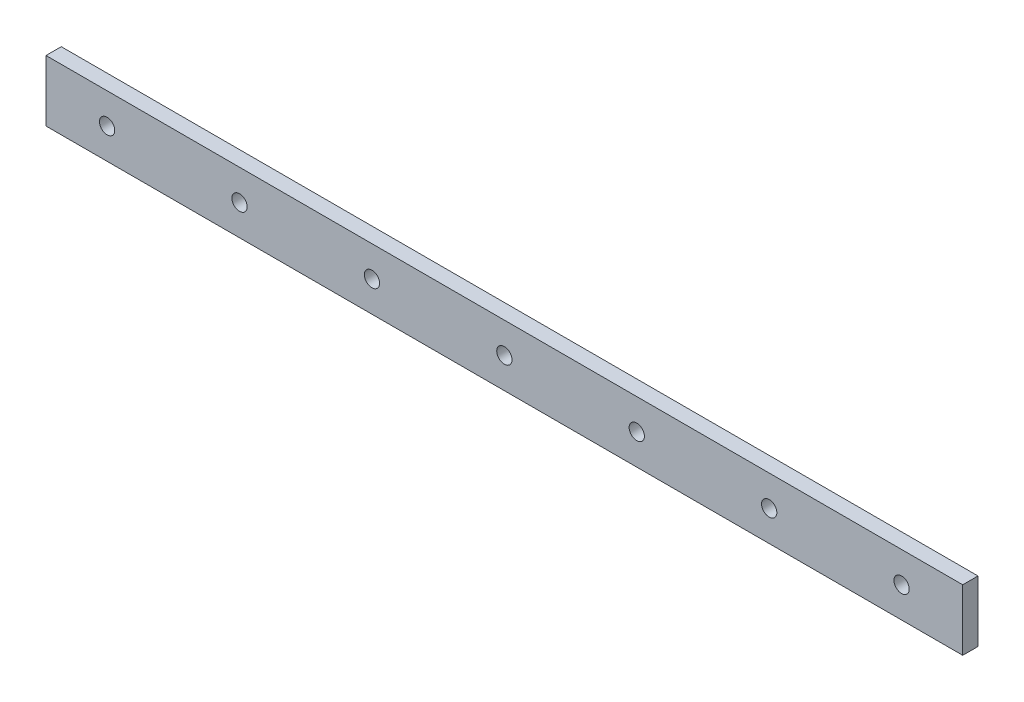
ISO-10303-21;
HEADER;
FILE_DESCRIPTION(('STEP AP214'),'2;1');
FILE_NAME('part.step','',(''),(''),'','','');
FILE_SCHEMA(('AUTOMOTIVE_DESIGN { 1 0 10303 214 1 1 1 1 }'));
ENDSEC;
DATA;
#1=APPLICATION_CONTEXT('core data for automotive mechanical design processes');
#2=APPLICATION_PROTOCOL_DEFINITION('international standard','automotive_design',2000,#1);
#3=PRODUCT_CONTEXT('',#1,'mechanical');
#4=PRODUCT('Part','Part','',(#3));
#5=PRODUCT_RELATED_PRODUCT_CATEGORY('part','',(#4));
#6=PRODUCT_DEFINITION_FORMATION('','',#4);
#7=PRODUCT_DEFINITION_CONTEXT('part definition',#1,'design');
#8=PRODUCT_DEFINITION('design','',#6,#7);
#9=PRODUCT_DEFINITION_SHAPE('','',#8);
#10=(LENGTH_UNIT() NAMED_UNIT(*) SI_UNIT(.MILLI.,.METRE.));
#11=(NAMED_UNIT(*) PLANE_ANGLE_UNIT() SI_UNIT($,.RADIAN.));
#12=(NAMED_UNIT(*) SI_UNIT($,.STERADIAN.) SOLID_ANGLE_UNIT());
#13=UNCERTAINTY_MEASURE_WITH_UNIT(LENGTH_MEASURE(1.E-05),#10,'distance_accuracy_value','');
#14=(GEOMETRIC_REPRESENTATION_CONTEXT(3) GLOBAL_UNCERTAINTY_ASSIGNED_CONTEXT((#13)) GLOBAL_UNIT_ASSIGNED_CONTEXT((#10,
#11,#12)) REPRESENTATION_CONTEXT('',''));
#15=CARTESIAN_POINT('',(0.,0.,0.));
#16=DIRECTION('',(0.,0.,1.));
#17=DIRECTION('',(1.,0.,0.));
#18=AXIS2_PLACEMENT_3D('',#15,#16,#17);
#19=CARTESIAN_POINT('',(150.,10.,5.));
#20=DIRECTION('',(-1.,0.,0.));
#21=DIRECTION('',(0.,0.,1.));
#22=AXIS2_PLACEMENT_3D('',#19,#20,#21);
#23=PLANE('',#22);
#24=DIRECTION('',(0.,1.,0.));
#25=VECTOR('',#24,1.);
#26=CARTESIAN_POINT('',(150.,10.,0.));
#27=LINE('',#26,#25);
#28=CARTESIAN_POINT('',(150.,-10.,0.));
#29=VERTEX_POINT('',#28);
#30=CARTESIAN_POINT('',(150.,10.,0.));
#31=VERTEX_POINT('',#30);
#32=EDGE_CURVE('E104',#29,#31,#27,.T.);
#33=ORIENTED_EDGE('',*,*,#32,.T.);
#34=DIRECTION('',(0.,0.,-1.));
#35=VECTOR('',#34,1.);
#36=CARTESIAN_POINT('',(150.,10.,5.));
#37=LINE('',#36,#35);
#38=CARTESIAN_POINT('',(150.,10.,5.));
#39=VERTEX_POINT('',#38);
#40=EDGE_CURVE('E95',#39,#31,#37,.T.);
#41=ORIENTED_EDGE('',*,*,#40,.F.);
#42=DIRECTION('',(0.,1.,0.));
#43=VECTOR('',#42,1.);
#44=CARTESIAN_POINT('',(150.,10.,5.));
#45=LINE('',#44,#43);
#46=CARTESIAN_POINT('',(150.,-10.,5.));
#47=VERTEX_POINT('',#46);
#48=EDGE_CURVE('E89',#47,#39,#45,.T.);
#49=ORIENTED_EDGE('',*,*,#48,.F.);
#50=DIRECTION('',(0.,0.,-1.));
#51=VECTOR('',#50,1.);
#52=CARTESIAN_POINT('',(150.,-10.,5.));
#53=LINE('',#52,#51);
#54=EDGE_CURVE('E100',#47,#29,#53,.T.);
#55=ORIENTED_EDGE('',*,*,#54,.T.);
#56=EDGE_LOOP('',(#33,#41,#49,#55));
#57=FACE_BOUND('',#56,.T.);
#58=ADVANCED_FACE('F35',(#57),#23,.F.);
#59=CARTESIAN_POINT('',(-150.,10.,5.));
#60=DIRECTION('',(0.,-1.,0.));
#61=DIRECTION('',(0.,0.,-1.));
#62=AXIS2_PLACEMENT_3D('',#59,#60,#61);
#63=PLANE('',#62);
#64=DIRECTION('',(-1.,0.,0.));
#65=VECTOR('',#64,1.);
#66=CARTESIAN_POINT('',(-150.,10.,0.));
#67=LINE('',#66,#65);
#68=CARTESIAN_POINT('',(-150.,10.,0.));
#69=VERTEX_POINT('',#68);
#70=EDGE_CURVE('E94',#31,#69,#67,.T.);
#71=ORIENTED_EDGE('',*,*,#70,.T.);
#72=DIRECTION('',(0.,0.,-1.));
#73=VECTOR('',#72,1.);
#74=CARTESIAN_POINT('',(-150.,10.,5.));
#75=LINE('',#74,#73);
#76=CARTESIAN_POINT('',(-150.,10.,5.));
#77=VERTEX_POINT('',#76);
#78=EDGE_CURVE('E92',#77,#69,#75,.T.);
#79=ORIENTED_EDGE('',*,*,#78,.F.);
#80=DIRECTION('',(-1.,0.,0.));
#81=VECTOR('',#80,1.);
#82=CARTESIAN_POINT('',(-150.,10.,5.));
#83=LINE('',#82,#81);
#84=EDGE_CURVE('E83',#39,#77,#83,.T.);
#85=ORIENTED_EDGE('',*,*,#84,.F.);
#86=ORIENTED_EDGE('',*,*,#40,.T.);
#87=EDGE_LOOP('',(#71,#79,#85,#86));
#88=FACE_BOUND('',#87,.T.);
#89=ADVANCED_FACE('F93',(#88),#63,.F.);
#90=CARTESIAN_POINT('',(-150.,10.,5.));
#91=DIRECTION('',(1.,0.,0.));
#92=DIRECTION('',(0.,0.,-1.));
#93=AXIS2_PLACEMENT_3D('',#90,#91,#92);
#94=PLANE('',#93);
#95=DIRECTION('',(0.,-1.,0.));
#96=VECTOR('',#95,1.);
#97=CARTESIAN_POINT('',(-150.,10.,0.));
#98=LINE('',#97,#96);
#99=CARTESIAN_POINT('',(-150.,-10.,0.));
#100=VERTEX_POINT('',#99);
#101=EDGE_CURVE('E69',#69,#100,#98,.T.);
#102=ORIENTED_EDGE('',*,*,#101,.T.);
#103=DIRECTION('',(0.,0.,-1.));
#104=VECTOR('',#103,1.);
#105=CARTESIAN_POINT('',(-150.,-10.,5.));
#106=LINE('',#105,#104);
#107=CARTESIAN_POINT('',(-150.,-10.,5.));
#108=VERTEX_POINT('',#107);
#109=EDGE_CURVE('E96',#108,#100,#106,.T.);
#110=ORIENTED_EDGE('',*,*,#109,.F.);
#111=DIRECTION('',(0.,-1.,0.));
#112=VECTOR('',#111,1.);
#113=CARTESIAN_POINT('',(-150.,10.,5.));
#114=LINE('',#113,#112);
#115=EDGE_CURVE('E87',#77,#108,#114,.T.);
#116=ORIENTED_EDGE('',*,*,#115,.F.);
#117=ORIENTED_EDGE('',*,*,#78,.T.);
#118=EDGE_LOOP('',(#102,#110,#116,#117));
#119=FACE_BOUND('',#118,.T.);
#120=ADVANCED_FACE('F98',(#119),#94,.F.);
#121=CARTESIAN_POINT('',(-150.,-10.,5.));
#122=DIRECTION('',(0.,1.,0.));
#123=DIRECTION('',(0.,0.,1.));
#124=AXIS2_PLACEMENT_3D('',#121,#122,#123);
#125=PLANE('',#124);
#126=DIRECTION('',(1.,0.,0.));
#127=VECTOR('',#126,1.);
#128=CARTESIAN_POINT('',(-150.,-10.,0.));
#129=LINE('',#128,#127);
#130=EDGE_CURVE('E75',#100,#29,#129,.T.);
#131=ORIENTED_EDGE('',*,*,#130,.T.);
#132=ORIENTED_EDGE('',*,*,#54,.F.);
#133=DIRECTION('',(1.,0.,0.));
#134=VECTOR('',#133,1.);
#135=CARTESIAN_POINT('',(-150.,-10.,5.));
#136=LINE('',#135,#134);
#137=EDGE_CURVE('E52',#108,#47,#136,.T.);
#138=ORIENTED_EDGE('',*,*,#137,.F.);
#139=ORIENTED_EDGE('',*,*,#109,.T.);
#140=EDGE_LOOP('',(#131,#132,#138,#139));
#141=FACE_BOUND('',#140,.T.);
#142=ADVANCED_FACE('F142',(#141),#125,.F.);
#143=CARTESIAN_POINT('',(0.,0.,5.));
#144=DIRECTION('',(0.,0.,1.));
#145=DIRECTION('',(1.,0.,0.));
#146=AXIS2_PLACEMENT_3D('',#143,#144,#145);
#147=PLANE('',#146);
#148=CARTESIAN_POINT('',(-86.6666666666667,0.,5.));
#149=DIRECTION('',(0.,0.,1.));
#150=DIRECTION('',(1.,0.,0.));
#151=AXIS2_PLACEMENT_3D('',#148,#149,#150);
#152=CIRCLE('',#151,2.5);
#153=CARTESIAN_POINT('',(-84.1666666666667,0.,5.));
#154=VERTEX_POINT('',#153);
#155=EDGE_CURVE('E280',#154,#154,#152,.T.);
#156=ORIENTED_EDGE('',*,*,#155,.F.);
#157=EDGE_LOOP('',(#156));
#158=FACE_BOUND('',#157,.T.);
#159=CARTESIAN_POINT('',(130.,0.,5.));
#160=DIRECTION('',(0.,0.,1.));
#161=DIRECTION('',(1.,0.,0.));
#162=AXIS2_PLACEMENT_3D('',#159,#160,#161);
#163=CIRCLE('',#162,2.5);
#164=CARTESIAN_POINT('',(132.5,0.,5.));
#165=VERTEX_POINT('',#164);
#166=EDGE_CURVE('E275',#165,#165,#163,.T.);
#167=ORIENTED_EDGE('',*,*,#166,.F.);
#168=EDGE_LOOP('',(#167));
#169=FACE_BOUND('',#168,.T.);
#170=CARTESIAN_POINT('',(-130.,0.,5.));
#171=DIRECTION('',(0.,0.,1.));
#172=DIRECTION('',(1.,0.,0.));
#173=AXIS2_PLACEMENT_3D('',#170,#171,#172);
#174=CIRCLE('',#173,2.5);
#175=CARTESIAN_POINT('',(-127.5,0.,5.));
#176=VERTEX_POINT('',#175);
#177=EDGE_CURVE('E269',#176,#176,#174,.T.);
#178=ORIENTED_EDGE('',*,*,#177,.F.);
#179=EDGE_LOOP('',(#178));
#180=FACE_BOUND('',#179,.T.);
#181=ORIENTED_EDGE('',*,*,#48,.T.);
#182=ORIENTED_EDGE('',*,*,#84,.T.);
#183=ORIENTED_EDGE('',*,*,#115,.T.);
#184=ORIENTED_EDGE('',*,*,#137,.T.);
#185=EDGE_LOOP('',(#181,#182,#183,#184));
#186=FACE_BOUND('',#185,.T.);
#187=CARTESIAN_POINT('',(-43.3333333333333,0.,5.));
#188=DIRECTION('',(0.,0.,1.));
#189=DIRECTION('',(1.,0.,0.));
#190=AXIS2_PLACEMENT_3D('',#187,#188,#189);
#191=CIRCLE('',#190,2.5);
#192=CARTESIAN_POINT('',(-40.8333333333333,0.,5.));
#193=VERTEX_POINT('',#192);
#194=EDGE_CURVE('E117',#193,#193,#191,.T.);
#195=ORIENTED_EDGE('',*,*,#194,.F.);
#196=EDGE_LOOP('',(#195));
#197=FACE_BOUND('',#196,.T.);
#198=CARTESIAN_POINT('',(0.,0.,5.));
#199=DIRECTION('',(0.,0.,1.));
#200=DIRECTION('',(1.,0.,0.));
#201=AXIS2_PLACEMENT_3D('',#198,#199,#200);
#202=CIRCLE('',#201,2.5);
#203=CARTESIAN_POINT('',(2.5,0.,5.));
#204=VERTEX_POINT('',#203);
#205=EDGE_CURVE('E123',#204,#204,#202,.T.);
#206=ORIENTED_EDGE('',*,*,#205,.F.);
#207=EDGE_LOOP('',(#206));
#208=FACE_BOUND('',#207,.T.);
#209=CARTESIAN_POINT('',(43.3333333333333,0.,5.));
#210=DIRECTION('',(0.,0.,1.));
#211=DIRECTION('',(1.,0.,0.));
#212=AXIS2_PLACEMENT_3D('',#209,#210,#211);
#213=CIRCLE('',#212,2.5);
#214=CARTESIAN_POINT('',(45.8333333333333,0.,5.));
#215=VERTEX_POINT('',#214);
#216=EDGE_CURVE('E129',#215,#215,#213,.T.);
#217=ORIENTED_EDGE('',*,*,#216,.F.);
#218=EDGE_LOOP('',(#217));
#219=FACE_BOUND('',#218,.T.);
#220=CARTESIAN_POINT('',(86.6666666666667,0.,5.));
#221=DIRECTION('',(0.,0.,1.));
#222=DIRECTION('',(1.,0.,0.));
#223=AXIS2_PLACEMENT_3D('',#220,#221,#222);
#224=CIRCLE('',#223,2.5);
#225=CARTESIAN_POINT('',(89.1666666666667,0.,5.));
#226=VERTEX_POINT('',#225);
#227=EDGE_CURVE('E11',#226,#226,#224,.T.);
#228=ORIENTED_EDGE('',*,*,#227,.F.);
#229=EDGE_LOOP('',(#228));
#230=FACE_BOUND('',#229,.T.);
#231=ADVANCED_FACE('F84',(#158,#169,#180,#186,#197,#208,#219,#230),#147,.T.);
#232=CARTESIAN_POINT('',(0.,0.,0.));
#233=DIRECTION('',(0.,0.,1.));
#234=DIRECTION('',(1.,0.,0.));
#235=AXIS2_PLACEMENT_3D('',#232,#233,#234);
#236=PLANE('',#235);
#237=CARTESIAN_POINT('',(-86.6666666666667,0.,0.));
#238=DIRECTION('',(0.,0.,1.));
#239=DIRECTION('',(1.,0.,0.));
#240=AXIS2_PLACEMENT_3D('',#237,#238,#239);
#241=CIRCLE('',#240,2.5);
#242=CARTESIAN_POINT('',(-84.1666666666667,0.,0.));
#243=VERTEX_POINT('',#242);
#244=EDGE_CURVE('E283',#243,#243,#241,.T.);
#245=ORIENTED_EDGE('',*,*,#244,.T.);
#246=EDGE_LOOP('',(#245));
#247=FACE_BOUND('',#246,.T.);
#248=CARTESIAN_POINT('',(130.,0.,0.));
#249=DIRECTION('',(0.,0.,1.));
#250=DIRECTION('',(1.,0.,0.));
#251=AXIS2_PLACEMENT_3D('',#248,#249,#250);
#252=CIRCLE('',#251,2.5);
#253=CARTESIAN_POINT('',(132.5,0.,0.));
#254=VERTEX_POINT('',#253);
#255=EDGE_CURVE('E271',#254,#254,#252,.T.);
#256=ORIENTED_EDGE('',*,*,#255,.T.);
#257=EDGE_LOOP('',(#256));
#258=FACE_BOUND('',#257,.T.);
#259=CARTESIAN_POINT('',(-130.,0.,0.));
#260=DIRECTION('',(0.,0.,1.));
#261=DIRECTION('',(1.,0.,0.));
#262=AXIS2_PLACEMENT_3D('',#259,#260,#261);
#263=CIRCLE('',#262,2.5);
#264=CARTESIAN_POINT('',(-127.5,0.,0.));
#265=VERTEX_POINT('',#264);
#266=EDGE_CURVE('E107',#265,#265,#263,.T.);
#267=ORIENTED_EDGE('',*,*,#266,.T.);
#268=EDGE_LOOP('',(#267));
#269=FACE_BOUND('',#268,.T.);
#270=ORIENTED_EDGE('',*,*,#32,.F.);
#271=ORIENTED_EDGE('',*,*,#130,.F.);
#272=ORIENTED_EDGE('',*,*,#101,.F.);
#273=ORIENTED_EDGE('',*,*,#70,.F.);
#274=EDGE_LOOP('',(#270,#271,#272,#273));
#275=FACE_BOUND('',#274,.T.);
#276=CARTESIAN_POINT('',(-43.3333333333333,0.,0.));
#277=DIRECTION('',(0.,0.,1.));
#278=DIRECTION('',(1.,0.,0.));
#279=AXIS2_PLACEMENT_3D('',#276,#277,#278);
#280=CIRCLE('',#279,2.5);
#281=CARTESIAN_POINT('',(-40.8333333333333,0.,0.));
#282=VERTEX_POINT('',#281);
#283=EDGE_CURVE('E114',#282,#282,#280,.T.);
#284=ORIENTED_EDGE('',*,*,#283,.T.);
#285=EDGE_LOOP('',(#284));
#286=FACE_BOUND('',#285,.T.);
#287=CARTESIAN_POINT('',(0.,0.,0.));
#288=DIRECTION('',(0.,0.,1.));
#289=DIRECTION('',(1.,0.,0.));
#290=AXIS2_PLACEMENT_3D('',#287,#288,#289);
#291=CIRCLE('',#290,2.5);
#292=CARTESIAN_POINT('',(2.5,0.,0.));
#293=VERTEX_POINT('',#292);
#294=EDGE_CURVE('E120',#293,#293,#291,.T.);
#295=ORIENTED_EDGE('',*,*,#294,.T.);
#296=EDGE_LOOP('',(#295));
#297=FACE_BOUND('',#296,.T.);
#298=CARTESIAN_POINT('',(43.3333333333333,0.,0.));
#299=DIRECTION('',(0.,0.,1.));
#300=DIRECTION('',(1.,0.,0.));
#301=AXIS2_PLACEMENT_3D('',#298,#299,#300);
#302=CIRCLE('',#301,2.5);
#303=CARTESIAN_POINT('',(45.8333333333333,0.,0.));
#304=VERTEX_POINT('',#303);
#305=EDGE_CURVE('E126',#304,#304,#302,.T.);
#306=ORIENTED_EDGE('',*,*,#305,.T.);
#307=EDGE_LOOP('',(#306));
#308=FACE_BOUND('',#307,.T.);
#309=CARTESIAN_POINT('',(86.6666666666667,0.,0.));
#310=DIRECTION('',(0.,0.,1.));
#311=DIRECTION('',(1.,0.,0.));
#312=AXIS2_PLACEMENT_3D('',#309,#310,#311);
#313=CIRCLE('',#312,2.5);
#314=CARTESIAN_POINT('',(89.1666666666667,0.,0.));
#315=VERTEX_POINT('',#314);
#316=EDGE_CURVE('E44',#315,#315,#313,.T.);
#317=ORIENTED_EDGE('',*,*,#316,.T.);
#318=EDGE_LOOP('',(#317));
#319=FACE_BOUND('',#318,.T.);
#320=ADVANCED_FACE('F134',(#247,#258,#269,#275,#286,#297,#308,#319),#236,.F.);
#321=CARTESIAN_POINT('',(-130.,0.,5.));
#322=DIRECTION('',(0.,0.,1.));
#323=DIRECTION('',(1.,0.,0.));
#324=AXIS2_PLACEMENT_3D('',#321,#322,#323);
#325=CYLINDRICAL_SURFACE('',#324,2.5);
#326=ORIENTED_EDGE('',*,*,#266,.F.);
#327=EDGE_LOOP('',(#326));
#328=FACE_BOUND('',#327,.T.);
#329=ORIENTED_EDGE('',*,*,#177,.T.);
#330=EDGE_LOOP('',(#329));
#331=FACE_BOUND('',#330,.T.);
#332=ADVANCED_FACE('F149',(#328,#331),#325,.F.);
#333=CARTESIAN_POINT('',(130.,0.,5.));
#334=DIRECTION('',(0.,0.,1.));
#335=DIRECTION('',(1.,0.,0.));
#336=AXIS2_PLACEMENT_3D('',#333,#334,#335);
#337=CYLINDRICAL_SURFACE('',#336,2.5);
#338=ORIENTED_EDGE('',*,*,#255,.F.);
#339=EDGE_LOOP('',(#338));
#340=FACE_BOUND('',#339,.T.);
#341=ORIENTED_EDGE('',*,*,#166,.T.);
#342=EDGE_LOOP('',(#341));
#343=FACE_BOUND('',#342,.T.);
#344=ADVANCED_FACE('F209',(#340,#343),#337,.F.);
#345=CARTESIAN_POINT('',(-86.6666666666667,0.,5.));
#346=DIRECTION('',(0.,0.,1.));
#347=DIRECTION('',(1.,0.,0.));
#348=AXIS2_PLACEMENT_3D('',#345,#346,#347);
#349=CYLINDRICAL_SURFACE('',#348,2.5);
#350=ORIENTED_EDGE('',*,*,#244,.F.);
#351=EDGE_LOOP('',(#350));
#352=FACE_BOUND('',#351,.T.);
#353=ORIENTED_EDGE('',*,*,#155,.T.);
#354=EDGE_LOOP('',(#353));
#355=FACE_BOUND('',#354,.T.);
#356=ADVANCED_FACE('F169',(#352,#355),#349,.F.);
#357=CARTESIAN_POINT('',(-43.3333333333333,0.,5.));
#358=DIRECTION('',(0.,0.,1.));
#359=DIRECTION('',(1.,0.,0.));
#360=AXIS2_PLACEMENT_3D('',#357,#358,#359);
#361=CYLINDRICAL_SURFACE('',#360,2.5);
#362=ORIENTED_EDGE('',*,*,#283,.F.);
#363=EDGE_LOOP('',(#362));
#364=FACE_BOUND('',#363,.T.);
#365=ORIENTED_EDGE('',*,*,#194,.T.);
#366=EDGE_LOOP('',(#365));
#367=FACE_BOUND('',#366,.T.);
#368=ADVANCED_FACE('F165',(#364,#367),#361,.F.);
#369=CARTESIAN_POINT('',(0.,0.,5.));
#370=DIRECTION('',(0.,0.,1.));
#371=DIRECTION('',(1.,0.,0.));
#372=AXIS2_PLACEMENT_3D('',#369,#370,#371);
#373=CYLINDRICAL_SURFACE('',#372,2.5);
#374=ORIENTED_EDGE('',*,*,#294,.F.);
#375=EDGE_LOOP('',(#374));
#376=FACE_BOUND('',#375,.T.);
#377=ORIENTED_EDGE('',*,*,#205,.T.);
#378=EDGE_LOOP('',(#377));
#379=FACE_BOUND('',#378,.T.);
#380=ADVANCED_FACE('F168',(#376,#379),#373,.F.);
#381=CARTESIAN_POINT('',(43.3333333333333,0.,5.));
#382=DIRECTION('',(0.,0.,1.));
#383=DIRECTION('',(1.,0.,0.));
#384=AXIS2_PLACEMENT_3D('',#381,#382,#383);
#385=CYLINDRICAL_SURFACE('',#384,2.5);
#386=ORIENTED_EDGE('',*,*,#305,.F.);
#387=EDGE_LOOP('',(#386));
#388=FACE_BOUND('',#387,.T.);
#389=ORIENTED_EDGE('',*,*,#216,.T.);
#390=EDGE_LOOP('',(#389));
#391=FACE_BOUND('',#390,.T.);
#392=ADVANCED_FACE('F138',(#388,#391),#385,.F.);
#393=CARTESIAN_POINT('',(86.6666666666667,0.,5.));
#394=DIRECTION('',(0.,0.,1.));
#395=DIRECTION('',(1.,0.,0.));
#396=AXIS2_PLACEMENT_3D('',#393,#394,#395);
#397=CYLINDRICAL_SURFACE('',#396,2.5);
#398=ORIENTED_EDGE('',*,*,#316,.F.);
#399=EDGE_LOOP('',(#398));
#400=FACE_BOUND('',#399,.T.);
#401=ORIENTED_EDGE('',*,*,#227,.T.);
#402=EDGE_LOOP('',(#401));
#403=FACE_BOUND('',#402,.T.);
#404=ADVANCED_FACE('F37',(#400,#403),#397,.F.);
#405=CLOSED_SHELL('',(#58,#89,#120,#142,#231,#320,#332,#344,#356,#368,#380,#392,#404));
#406=MANIFOLD_SOLID_BREP('B2',#405);
#407=ADVANCED_BREP_SHAPE_REPRESENTATION('',(#18,#406),#14);
#408=SHAPE_DEFINITION_REPRESENTATION(#9,#407);
ENDSEC;
END-ISO-10303-21;
